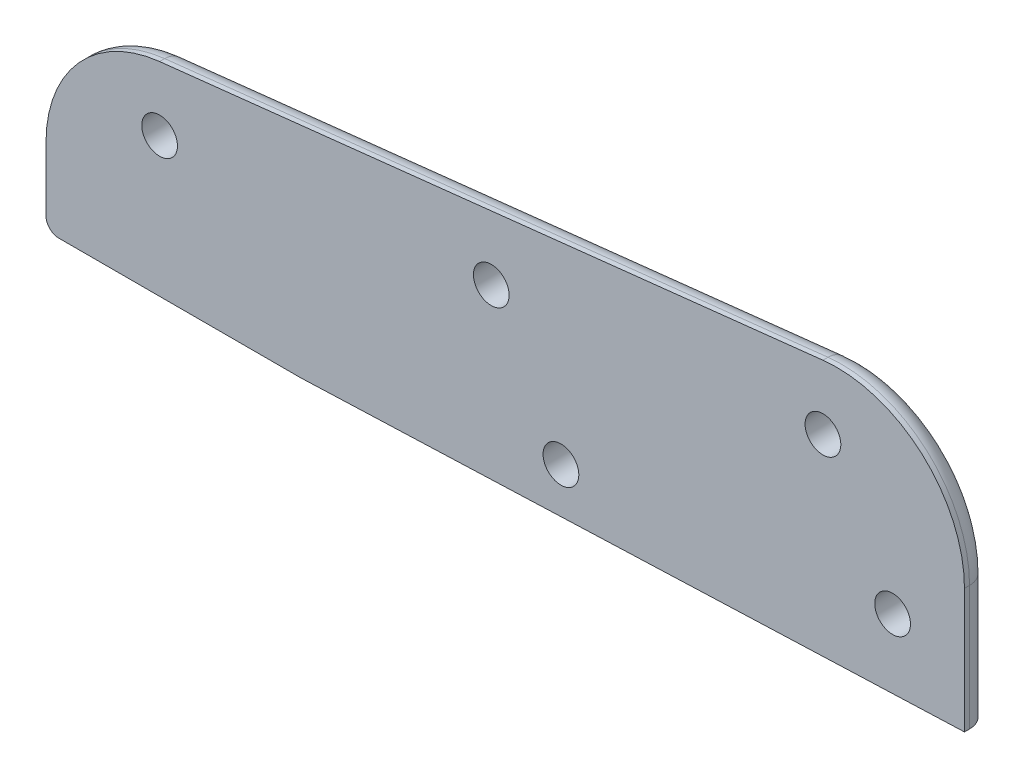
ISO-10303-21;
HEADER;
FILE_DESCRIPTION(('STEP AP214'),'2;1');
FILE_NAME('part.step','',(''),(''),'','','');
FILE_SCHEMA(('AUTOMOTIVE_DESIGN { 1 0 10303 214 1 1 1 1 }'));
ENDSEC;
DATA;
#1=APPLICATION_CONTEXT('core data for automotive mechanical design processes');
#2=APPLICATION_PROTOCOL_DEFINITION('international standard','automotive_design',2000,#1);
#3=PRODUCT_CONTEXT('',#1,'mechanical');
#4=PRODUCT('Part','Part','',(#3));
#5=PRODUCT_RELATED_PRODUCT_CATEGORY('part','',(#4));
#6=PRODUCT_DEFINITION_FORMATION('','',#4);
#7=PRODUCT_DEFINITION_CONTEXT('part definition',#1,'design');
#8=PRODUCT_DEFINITION('design','',#6,#7);
#9=PRODUCT_DEFINITION_SHAPE('','',#8);
#10=(LENGTH_UNIT() NAMED_UNIT(*) SI_UNIT(.MILLI.,.METRE.));
#11=(NAMED_UNIT(*) PLANE_ANGLE_UNIT() SI_UNIT($,.RADIAN.));
#12=(NAMED_UNIT(*) SI_UNIT($,.STERADIAN.) SOLID_ANGLE_UNIT());
#13=UNCERTAINTY_MEASURE_WITH_UNIT(LENGTH_MEASURE(1.E-05),#10,'distance_accuracy_value','');
#14=(GEOMETRIC_REPRESENTATION_CONTEXT(3) GLOBAL_UNCERTAINTY_ASSIGNED_CONTEXT((#13)) GLOBAL_UNIT_ASSIGNED_CONTEXT((#10,
#11,#12)) REPRESENTATION_CONTEXT('',''));
#15=CARTESIAN_POINT('',(0.,0.,0.));
#16=DIRECTION('',(0.,0.,1.));
#17=DIRECTION('',(1.,0.,0.));
#18=AXIS2_PLACEMENT_3D('',#15,#16,#17);
#19=CARTESIAN_POINT('',(-483.453171779433,1624.005304703,3085.));
#20=DIRECTION('',(0.,0.,-1.));
#21=DIRECTION('',(-1.,0.,0.));
#22=AXIS2_PLACEMENT_3D('',#19,#20,#21);
#23=CYLINDRICAL_SURFACE('',#22,50.0000000000001);
#24=DIRECTION('',(0.,0.,-1.));
#25=VECTOR('',#24,1.);
#26=CARTESIAN_POINT('',(-433.453171779433,1624.005304703,3085.));
#27=LINE('',#26,#25);
#28=CARTESIAN_POINT('',(-433.453171779433,1624.005304703,3085.));
#29=VERTEX_POINT('',#28);
#30=CARTESIAN_POINT('',(-433.453171779433,1624.005304703,3083.));
#31=VERTEX_POINT('',#30);
#32=EDGE_CURVE('E222',#29,#31,#27,.T.);
#33=ORIENTED_EDGE('',*,*,#32,.T.);
#34=CARTESIAN_POINT('',(-483.453171779433,1624.005304703,3083.));
#35=DIRECTION('',(0.,0.,1.));
#36=DIRECTION('',(1.,0.,0.));
#37=AXIS2_PLACEMENT_3D('',#34,#35,#36);
#38=CIRCLE('',#37,50.0000000000001);
#39=CARTESIAN_POINT('',(-488.924269857036,1673.70507417757,3083.));
#40=VERTEX_POINT('',#39);
#41=EDGE_CURVE('E144',#31,#40,#38,.T.);
#42=ORIENTED_EDGE('',*,*,#41,.T.);
#43=DIRECTION('',(0.,0.,-1.));
#44=VECTOR('',#43,1.);
#45=CARTESIAN_POINT('',(-488.924269857036,1673.70507417757,3085.));
#46=LINE('',#45,#44);
#47=CARTESIAN_POINT('',(-488.924269857036,1673.70507417757,3085.));
#48=VERTEX_POINT('',#47);
#49=EDGE_CURVE('E125',#48,#40,#46,.T.);
#50=ORIENTED_EDGE('',*,*,#49,.F.);
#51=CARTESIAN_POINT('',(-483.453171779433,1624.005304703,3085.));
#52=DIRECTION('',(0.,0.,1.));
#53=DIRECTION('',(1.,0.,0.));
#54=AXIS2_PLACEMENT_3D('',#51,#52,#53);
#55=CIRCLE('',#54,50.0000000000001);
#56=EDGE_CURVE('E131',#29,#48,#55,.T.);
#57=ORIENTED_EDGE('',*,*,#56,.F.);
#58=EDGE_LOOP('',(#33,#42,#50,#57));
#59=FACE_BOUND('',#58,.T.);
#60=ADVANCED_FACE('F36',(#59),#23,.T.);
#61=CARTESIAN_POINT('',(-488.924269857036,1673.70507417757,3085.));
#62=DIRECTION('',(0.10942196155205,-0.993995389491371,0.));
#63=DIRECTION('',(0.993995389491371,0.10942196155205,0.));
#64=AXIS2_PLACEMENT_3D('',#61,#62,#63);
#65=PLANE('',#64);
#66=ORIENTED_EDGE('',*,*,#49,.T.);
#67=DIRECTION('',(-0.993995389491371,-0.10942196155205,0.));
#68=VECTOR('',#67,1.);
#69=CARTESIAN_POINT('',(-488.924269857036,1673.70507417757,3083.));
#70=LINE('',#69,#68);
#71=CARTESIAN_POINT('',(-748.924269857035,1645.08350278568,3083.));
#72=VERTEX_POINT('',#71);
#73=EDGE_CURVE('E11',#40,#72,#70,.T.);
#74=ORIENTED_EDGE('',*,*,#73,.T.);
#75=DIRECTION('',(0.,0.,-1.));
#76=VECTOR('',#75,1.);
#77=CARTESIAN_POINT('',(-748.924269857035,1645.08350278568,3085.));
#78=LINE('',#77,#76);
#79=CARTESIAN_POINT('',(-748.924269857035,1645.08350278568,3085.));
#80=VERTEX_POINT('',#79);
#81=EDGE_CURVE('E126',#80,#72,#78,.T.);
#82=ORIENTED_EDGE('',*,*,#81,.F.);
#83=DIRECTION('',(-0.993995389491371,-0.10942196155205,0.));
#84=VECTOR('',#83,1.);
#85=CARTESIAN_POINT('',(-488.924269857036,1673.70507417757,3085.));
#86=LINE('',#85,#84);
#87=EDGE_CURVE('E121',#48,#80,#86,.T.);
#88=ORIENTED_EDGE('',*,*,#87,.F.);
#89=EDGE_LOOP('',(#66,#74,#82,#88));
#90=FACE_BOUND('',#89,.T.);
#91=ADVANCED_FACE('F123',(#90),#65,.F.);
#92=CARTESIAN_POINT('',(-743.453171779433,1595.38373331111,3085.));
#93=DIRECTION('',(0.,0.,-1.));
#94=DIRECTION('',(-1.,0.,0.));
#95=AXIS2_PLACEMENT_3D('',#92,#93,#94);
#96=CYLINDRICAL_SURFACE('',#95,50.0000000000001);
#97=ORIENTED_EDGE('',*,*,#81,.T.);
#98=CARTESIAN_POINT('',(-743.453171779433,1595.38373331111,3083.));
#99=DIRECTION('',(0.,0.,1.));
#100=DIRECTION('',(1.,0.,0.));
#101=AXIS2_PLACEMENT_3D('',#98,#99,#100);
#102=CIRCLE('',#101,50.0000000000001);
#103=CARTESIAN_POINT('',(-793.453171779433,1595.38373331111,3083.));
#104=VERTEX_POINT('',#103);
#105=EDGE_CURVE('E46',#72,#104,#102,.T.);
#106=ORIENTED_EDGE('',*,*,#105,.T.);
#107=DIRECTION('',(0.,0.,-1.));
#108=VECTOR('',#107,1.);
#109=CARTESIAN_POINT('',(-793.453171779433,1595.38373331111,3085.));
#110=LINE('',#109,#108);
#111=CARTESIAN_POINT('',(-793.453171779433,1595.38373331111,3085.));
#112=VERTEX_POINT('',#111);
#113=EDGE_CURVE('E150',#112,#104,#110,.T.);
#114=ORIENTED_EDGE('',*,*,#113,.F.);
#115=CARTESIAN_POINT('',(-743.453171779433,1595.38373331111,3085.));
#116=DIRECTION('',(0.,0.,-1.));
#117=DIRECTION('',(-1.,0.,0.));
#118=AXIS2_PLACEMENT_3D('',#115,#116,#117);
#119=CIRCLE('',#118,50.0000000000001);
#120=EDGE_CURVE('E130',#112,#80,#119,.T.);
#121=ORIENTED_EDGE('',*,*,#120,.T.);
#122=EDGE_LOOP('',(#97,#106,#114,#121));
#123=FACE_BOUND('',#122,.T.);
#124=ADVANCED_FACE('F265',(#123),#96,.T.);
#125=CARTESIAN_POINT('',(-793.453171779433,1595.38373331111,3085.));
#126=DIRECTION('',(1.,0.,0.));
#127=DIRECTION('',(0.,0.,-1.));
#128=AXIS2_PLACEMENT_3D('',#125,#126,#127);
#129=PLANE('',#128);
#130=ORIENTED_EDGE('',*,*,#113,.T.);
#131=DIRECTION('',(0.,-1.,0.));
#132=VECTOR('',#131,1.);
#133=CARTESIAN_POINT('',(-793.453171779433,1595.38373331111,3083.));
#134=LINE('',#133,#132);
#135=CARTESIAN_POINT('',(-793.453171779433,1570.37512715189,3083.));
#136=VERTEX_POINT('',#135);
#137=EDGE_CURVE('E181',#104,#136,#134,.T.);
#138=ORIENTED_EDGE('',*,*,#137,.T.);
#139=DIRECTION('',(0.,0.,-1.));
#140=VECTOR('',#139,1.);
#141=CARTESIAN_POINT('',(-793.453171779433,1570.37512715189,3085.));
#142=LINE('',#141,#140);
#143=CARTESIAN_POINT('',(-793.453171779433,1570.37512715189,3085.));
#144=VERTEX_POINT('',#143);
#145=EDGE_CURVE('E148',#136,#144,#142,.F.);
#146=ORIENTED_EDGE('',*,*,#145,.T.);
#147=DIRECTION('',(0.,-1.,0.));
#148=VECTOR('',#147,1.);
#149=CARTESIAN_POINT('',(-793.453171779433,1595.38373331111,3085.));
#150=LINE('',#149,#148);
#151=EDGE_CURVE('E215',#112,#144,#150,.T.);
#152=ORIENTED_EDGE('',*,*,#151,.F.);
#153=EDGE_LOOP('',(#130,#138,#146,#152));
#154=FACE_BOUND('',#153,.T.);
#155=ADVANCED_FACE('F235',(#154),#129,.F.);
#156=CARTESIAN_POINT('',(-793.453171779433,1565.37512715189,3085.));
#157=DIRECTION('',(0.,1.,0.));
#158=DIRECTION('',(0.,0.,1.));
#159=AXIS2_PLACEMENT_3D('',#156,#157,#158);
#160=PLANE('',#159);
#161=DIRECTION('',(0.,0.,-1.));
#162=VECTOR('',#161,1.);
#163=CARTESIAN_POINT('',(-788.453171779433,1565.37512715189,3085.));
#164=LINE('',#163,#162);
#165=CARTESIAN_POINT('',(-788.453171779433,1565.37512715189,3085.));
#166=VERTEX_POINT('',#165);
#167=CARTESIAN_POINT('',(-788.453171779433,1565.37512715189,3083.));
#168=VERTEX_POINT('',#167);
#169=EDGE_CURVE('E145',#166,#168,#164,.T.);
#170=ORIENTED_EDGE('',*,*,#169,.T.);
#171=DIRECTION('',(1.,0.,0.));
#172=VECTOR('',#171,1.);
#173=CARTESIAN_POINT('',(-793.453171779433,1565.37512715189,3083.));
#174=LINE('',#173,#172);
#175=CARTESIAN_POINT('',(-693.453171779433,1565.37512715189,3083.));
#176=VERTEX_POINT('',#175);
#177=EDGE_CURVE('E177',#168,#176,#174,.T.);
#178=ORIENTED_EDGE('',*,*,#177,.T.);
#179=DIRECTION('',(0.,0.,-1.));
#180=VECTOR('',#179,1.);
#181=CARTESIAN_POINT('',(-693.453171779433,1565.37512715189,3085.));
#182=LINE('',#181,#180);
#183=CARTESIAN_POINT('',(-693.453171779433,1565.37512715189,3085.));
#184=VERTEX_POINT('',#183);
#185=EDGE_CURVE('E230',#184,#176,#182,.T.);
#186=ORIENTED_EDGE('',*,*,#185,.F.);
#187=DIRECTION('',(1.,0.,0.));
#188=VECTOR('',#187,1.);
#189=CARTESIAN_POINT('',(-793.453171779433,1565.37512715189,3085.));
#190=LINE('',#189,#188);
#191=EDGE_CURVE('E217',#166,#184,#190,.T.);
#192=ORIENTED_EDGE('',*,*,#191,.F.);
#193=EDGE_LOOP('',(#170,#178,#186,#192));
#194=FACE_BOUND('',#193,.T.);
#195=ADVANCED_FACE('F261',(#194),#160,.F.);
#196=CARTESIAN_POINT('',(-693.453171779433,1565.37512715189,3085.));
#197=DIRECTION('',(-0.0379732750898803,0.999278755092366,0.));
#198=DIRECTION('',(-0.999278755092366,-0.0379732750898803,0.));
#199=AXIS2_PLACEMENT_3D('',#196,#197,#198);
#200=PLANE('',#199);
#201=DIRECTION('',(0.999278755092366,0.0379732750898803,0.));
#202=VECTOR('',#201,1.);
#203=CARTESIAN_POINT('',(-693.453171779433,1565.37512715189,3075.));
#204=LINE('',#203,#202);
#205=CARTESIAN_POINT('',(-482.93063923998,1573.37512715189,3075.));
#206=VERTEX_POINT('',#205);
#207=CARTESIAN_POINT('',(-441.453171779433,1574.95129923989,3075.));
#208=VERTEX_POINT('',#207);
#209=EDGE_CURVE('E141',#206,#208,#204,.T.);
#210=ORIENTED_EDGE('',*,*,#209,.T.);
#211=CARTESIAN_POINT('',(-441.453171779433,1574.95129923989,3083.));
#212=DIRECTION('',(-0.0379732750898803,0.999278755092366,0.));
#213=DIRECTION('',(0.999278755092366,0.0379732750898803,0.));
#214=AXIS2_PLACEMENT_3D('',#211,#212,#213);
#215=ELLIPSE('',#214,8.00577412381847,8.);
#216=CARTESIAN_POINT('',(-433.453171779433,1575.255304703,3083.));
#217=VERTEX_POINT('',#216);
#218=EDGE_CURVE('E174',#208,#217,#215,.F.);
#219=ORIENTED_EDGE('',*,*,#218,.T.);
#220=DIRECTION('',(0.,0.,-1.));
#221=VECTOR('',#220,1.);
#222=CARTESIAN_POINT('',(-433.453171779433,1575.255304703,3085.));
#223=LINE('',#222,#221);
#224=CARTESIAN_POINT('',(-433.453171779433,1575.255304703,3085.));
#225=VERTEX_POINT('',#224);
#226=EDGE_CURVE('E227',#225,#217,#223,.T.);
#227=ORIENTED_EDGE('',*,*,#226,.F.);
#228=DIRECTION('',(0.999278755092366,0.0379732750898803,0.));
#229=VECTOR('',#228,1.);
#230=CARTESIAN_POINT('',(-693.453171779433,1565.37512715189,3085.));
#231=LINE('',#230,#229);
#232=EDGE_CURVE('E219',#184,#225,#231,.T.);
#233=ORIENTED_EDGE('',*,*,#232,.F.);
#234=ORIENTED_EDGE('',*,*,#185,.T.);
#235=CARTESIAN_POINT('',(-482.93063923998,1573.37512715189,3083.));
#236=DIRECTION('',(-0.0379732750898803,0.999278755092366,0.));
#237=DIRECTION('',(0.999278755092366,0.0379732750898803,0.));
#238=AXIS2_PLACEMENT_3D('',#235,#236,#237);
#239=ELLIPSE('',#238,210.674480435636,8.);
#240=EDGE_CURVE('E172',#176,#206,#239,.F.);
#241=ORIENTED_EDGE('',*,*,#240,.T.);
#242=EDGE_LOOP('',(#210,#219,#227,#233,#234,#241));
#243=FACE_BOUND('',#242,.T.);
#244=ADVANCED_FACE('F370',(#243),#200,.F.);
#245=CARTESIAN_POINT('',(-433.453171779433,1575.255304703,3085.));
#246=DIRECTION('',(-1.,0.,0.));
#247=DIRECTION('',(0.,-1.,0.));
#248=AXIS2_PLACEMENT_3D('',#245,#246,#247);
#249=PLANE('',#248);
#250=ORIENTED_EDGE('',*,*,#226,.T.);
#251=DIRECTION('',(0.,1.,0.));
#252=VECTOR('',#251,1.);
#253=CARTESIAN_POINT('',(-433.453171779433,1575.255304703,3083.));
#254=LINE('',#253,#252);
#255=EDGE_CURVE('E157',#217,#31,#254,.T.);
#256=ORIENTED_EDGE('',*,*,#255,.T.);
#257=ORIENTED_EDGE('',*,*,#32,.F.);
#258=DIRECTION('',(0.,1.,0.));
#259=VECTOR('',#258,1.);
#260=CARTESIAN_POINT('',(-433.453171779433,1575.255304703,3085.));
#261=LINE('',#260,#259);
#262=EDGE_CURVE('E137',#225,#29,#261,.T.);
#263=ORIENTED_EDGE('',*,*,#262,.F.);
#264=EDGE_LOOP('',(#250,#256,#257,#263));
#265=FACE_BOUND('',#264,.T.);
#266=ADVANCED_FACE('F363',(#265),#249,.F.);
#267=CARTESIAN_POINT('',(-483.453171779433,1624.005304703,3085.));
#268=DIRECTION('',(0.,0.,1.));
#269=DIRECTION('',(1.,0.,0.));
#270=AXIS2_PLACEMENT_3D('',#267,#268,#269);
#271=PLANE('',#270);
#272=CARTESIAN_POINT('',(-488.924269857036,1648.55405208602,3085.));
#273=DIRECTION('',(0.,0.,-1.));
#274=DIRECTION('',(-1.,0.,0.));
#275=AXIS2_PLACEMENT_3D('',#272,#273,#274);
#276=CIRCLE('',#275,7.00000000000004);
#277=CARTESIAN_POINT('',(-495.924269857036,1648.55405208602,3085.));
#278=VERTEX_POINT('',#277);
#279=EDGE_CURVE('E225',#278,#278,#276,.T.);
#280=ORIENTED_EDGE('',*,*,#279,.T.);
#281=EDGE_LOOP('',(#280));
#282=FACE_BOUND('',#281,.T.);
#283=CARTESIAN_POINT('',(-618.924269857036,1634.24326639007,3085.));
#284=DIRECTION('',(0.,0.,-1.));
#285=DIRECTION('',(-1.,0.,0.));
#286=AXIS2_PLACEMENT_3D('',#283,#284,#285);
#287=CIRCLE('',#286,7.00000000000004);
#288=CARTESIAN_POINT('',(-625.924269857036,1634.24326639007,3085.));
#289=VERTEX_POINT('',#288);
#290=EDGE_CURVE('E478',#289,#289,#287,.T.);
#291=ORIENTED_EDGE('',*,*,#290,.T.);
#292=EDGE_LOOP('',(#291));
#293=FACE_BOUND('',#292,.T.);
#294=CARTESIAN_POINT('',(-748.924269857036,1619.93248069413,3085.));
#295=DIRECTION('',(0.,0.,-1.));
#296=DIRECTION('',(-1.,0.,0.));
#297=AXIS2_PLACEMENT_3D('',#294,#295,#296);
#298=CIRCLE('',#297,7.00000000000004);
#299=CARTESIAN_POINT('',(-755.924269857036,1619.93248069413,3085.));
#300=VERTEX_POINT('',#299);
#301=EDGE_CURVE('E482',#300,#300,#298,.T.);
#302=ORIENTED_EDGE('',*,*,#301,.T.);
#303=EDGE_LOOP('',(#302));
#304=FACE_BOUND('',#303,.T.);
#305=CARTESIAN_POINT('',(-461.617868508506,1601.25797757849,3085.));
#306=DIRECTION('',(0.,0.,-1.));
#307=DIRECTION('',(-1.,0.,0.));
#308=AXIS2_PLACEMENT_3D('',#305,#306,#307);
#309=CIRCLE('',#308,6.99999999999999);
#310=CARTESIAN_POINT('',(-468.617868508506,1601.25797757849,3085.));
#311=VERTEX_POINT('',#310);
#312=EDGE_CURVE('E486',#311,#311,#309,.T.);
#313=ORIENTED_EDGE('',*,*,#312,.T.);
#314=EDGE_LOOP('',(#313));
#315=FACE_BOUND('',#314,.T.);
#316=CARTESIAN_POINT('',(-591.617868508506,1586.94719188255,3085.));
#317=DIRECTION('',(0.,0.,-1.));
#318=DIRECTION('',(-1.,0.,0.));
#319=AXIS2_PLACEMENT_3D('',#316,#317,#318);
#320=CIRCLE('',#319,7.00000000000004);
#321=CARTESIAN_POINT('',(-598.617868508506,1586.94719188255,3085.));
#322=VERTEX_POINT('',#321);
#323=EDGE_CURVE('E205',#322,#322,#320,.T.);
#324=ORIENTED_EDGE('',*,*,#323,.T.);
#325=EDGE_LOOP('',(#324));
#326=FACE_BOUND('',#325,.T.);
#327=ORIENTED_EDGE('',*,*,#151,.T.);
#328=CARTESIAN_POINT('',(-788.453171779433,1570.37512715189,3085.));
#329=DIRECTION('',(0.,0.,1.));
#330=DIRECTION('',(1.,0.,0.));
#331=AXIS2_PLACEMENT_3D('',#328,#329,#330);
#332=CIRCLE('',#331,5.);
#333=EDGE_CURVE('E155',#144,#166,#332,.T.);
#334=ORIENTED_EDGE('',*,*,#333,.T.);
#335=ORIENTED_EDGE('',*,*,#191,.T.);
#336=ORIENTED_EDGE('',*,*,#232,.T.);
#337=ORIENTED_EDGE('',*,*,#262,.T.);
#338=ORIENTED_EDGE('',*,*,#56,.T.);
#339=ORIENTED_EDGE('',*,*,#87,.T.);
#340=ORIENTED_EDGE('',*,*,#120,.F.);
#341=EDGE_LOOP('',(#327,#334,#335,#336,#337,#338,#339,#340));
#342=FACE_BOUND('',#341,.T.);
#343=ADVANCED_FACE('F135',(#282,#293,#304,#315,#326,#342),#271,.T.);
#344=CARTESIAN_POINT('',(-483.453171779433,1624.005304703,3075.));
#345=DIRECTION('',(0.,0.,1.));
#346=DIRECTION('',(1.,0.,0.));
#347=AXIS2_PLACEMENT_3D('',#344,#345,#346);
#348=PLANE('',#347);
#349=CARTESIAN_POINT('',(-488.924269857036,1648.55405208602,3075.));
#350=DIRECTION('',(0.,0.,-1.));
#351=DIRECTION('',(-1.,0.,0.));
#352=AXIS2_PLACEMENT_3D('',#349,#350,#351);
#353=CIRCLE('',#352,7.00000000000004);
#354=CARTESIAN_POINT('',(-495.924269857036,1648.55405208602,3075.));
#355=VERTEX_POINT('',#354);
#356=EDGE_CURVE('E499',#355,#355,#353,.T.);
#357=ORIENTED_EDGE('',*,*,#356,.F.);
#358=EDGE_LOOP('',(#357));
#359=FACE_BOUND('',#358,.T.);
#360=CARTESIAN_POINT('',(-618.924269857036,1634.24326639007,3075.));
#361=DIRECTION('',(0.,0.,-1.));
#362=DIRECTION('',(-1.,0.,0.));
#363=AXIS2_PLACEMENT_3D('',#360,#361,#362);
#364=CIRCLE('',#363,7.00000000000004);
#365=CARTESIAN_POINT('',(-625.924269857036,1634.24326639007,3075.));
#366=VERTEX_POINT('',#365);
#367=EDGE_CURVE('E495',#366,#366,#364,.T.);
#368=ORIENTED_EDGE('',*,*,#367,.F.);
#369=EDGE_LOOP('',(#368));
#370=FACE_BOUND('',#369,.T.);
#371=CARTESIAN_POINT('',(-748.924269857036,1619.93248069413,3075.));
#372=DIRECTION('',(0.,0.,-1.));
#373=DIRECTION('',(-1.,0.,0.));
#374=AXIS2_PLACEMENT_3D('',#371,#372,#373);
#375=CIRCLE('',#374,7.00000000000004);
#376=CARTESIAN_POINT('',(-755.924269857036,1619.93248069413,3075.));
#377=VERTEX_POINT('',#376);
#378=EDGE_CURVE('E488',#377,#377,#375,.T.);
#379=ORIENTED_EDGE('',*,*,#378,.F.);
#380=EDGE_LOOP('',(#379));
#381=FACE_BOUND('',#380,.T.);
#382=CARTESIAN_POINT('',(-461.617868508506,1601.25797757849,3075.));
#383=DIRECTION('',(0.,0.,-1.));
#384=DIRECTION('',(-1.,0.,0.));
#385=AXIS2_PLACEMENT_3D('',#382,#383,#384);
#386=CIRCLE('',#385,6.99999999999999);
#387=CARTESIAN_POINT('',(-468.617868508506,1601.25797757849,3075.));
#388=VERTEX_POINT('',#387);
#389=EDGE_CURVE('E210',#388,#388,#386,.T.);
#390=ORIENTED_EDGE('',*,*,#389,.F.);
#391=EDGE_LOOP('',(#390));
#392=FACE_BOUND('',#391,.T.);
#393=CARTESIAN_POINT('',(-591.617868508506,1586.94719188255,3075.));
#394=DIRECTION('',(0.,0.,-1.));
#395=DIRECTION('',(-1.,0.,0.));
#396=AXIS2_PLACEMENT_3D('',#393,#394,#395);
#397=CIRCLE('',#396,7.00000000000004);
#398=CARTESIAN_POINT('',(-598.617868508506,1586.94719188255,3075.));
#399=VERTEX_POINT('',#398);
#400=EDGE_CURVE('E199',#399,#399,#397,.T.);
#401=ORIENTED_EDGE('',*,*,#400,.F.);
#402=EDGE_LOOP('',(#401));
#403=FACE_BOUND('',#402,.T.);
#404=CARTESIAN_POINT('',(-483.453171779433,1624.005304703,3075.));
#405=DIRECTION('',(0.,0.,1.));
#406=DIRECTION('',(1.,0.,0.));
#407=AXIS2_PLACEMENT_3D('',#404,#405,#406);
#408=CIRCLE('',#407,42.0000000000001);
#409=CARTESIAN_POINT('',(-488.048894164619,1665.75311106164,3075.));
#410=VERTEX_POINT('',#409);
#411=CARTESIAN_POINT('',(-441.453171779433,1624.005304703,3075.));
#412=VERTEX_POINT('',#411);
#413=EDGE_CURVE('E168',#410,#412,#408,.F.);
#414=ORIENTED_EDGE('',*,*,#413,.T.);
#415=DIRECTION('',(0.,1.,0.));
#416=VECTOR('',#415,1.);
#417=CARTESIAN_POINT('',(-441.453171779433,1624.005304703,3075.));
#418=LINE('',#417,#416);
#419=EDGE_CURVE('E170',#412,#208,#418,.F.);
#420=ORIENTED_EDGE('',*,*,#419,.T.);
#421=ORIENTED_EDGE('',*,*,#209,.F.);
#422=DIRECTION('',(1.,0.,0.));
#423=VECTOR('',#422,1.);
#424=CARTESIAN_POINT('',(-483.453171779433,1573.37512715189,3075.));
#425=LINE('',#424,#423);
#426=CARTESIAN_POINT('',(-785.453171779433,1573.37512715189,3075.));
#427=VERTEX_POINT('',#426);
#428=EDGE_CURVE('E166',#206,#427,#425,.F.);
#429=ORIENTED_EDGE('',*,*,#428,.T.);
#430=DIRECTION('',(0.,-1.,0.));
#431=VECTOR('',#430,1.);
#432=CARTESIAN_POINT('',(-785.453171779433,1624.005304703,3075.));
#433=LINE('',#432,#431);
#434=CARTESIAN_POINT('',(-785.453171779433,1595.38373331111,3075.));
#435=VERTEX_POINT('',#434);
#436=EDGE_CURVE('E164',#427,#435,#433,.F.);
#437=ORIENTED_EDGE('',*,*,#436,.T.);
#438=CARTESIAN_POINT('',(-743.453171779433,1595.38373331111,3075.));
#439=DIRECTION('',(0.,0.,1.));
#440=DIRECTION('',(1.,0.,0.));
#441=AXIS2_PLACEMENT_3D('',#438,#439,#440);
#442=CIRCLE('',#441,42.0000000000001);
#443=CARTESIAN_POINT('',(-748.048894164619,1637.13153966975,3075.));
#444=VERTEX_POINT('',#443);
#445=EDGE_CURVE('E162',#435,#444,#442,.F.);
#446=ORIENTED_EDGE('',*,*,#445,.T.);
#447=DIRECTION('',(-0.993995389491371,-0.10942196155205,0.));
#448=VECTOR('',#447,1.);
#449=CARTESIAN_POINT('',(-488.048894164619,1665.75311106164,3075.));
#450=LINE('',#449,#448);
#451=EDGE_CURVE('E160',#444,#410,#450,.F.);
#452=ORIENTED_EDGE('',*,*,#451,.T.);
#453=EDGE_LOOP('',(#414,#420,#421,#429,#437,#446,#452));
#454=FACE_BOUND('',#453,.T.);
#455=ADVANCED_FACE('F247',(#359,#370,#381,#392,#403,#454),#348,.F.);
#456=CARTESIAN_POINT('',(-591.617868508506,1586.94719188255,3085.));
#457=DIRECTION('',(0.,0.,-1.));
#458=DIRECTION('',(-1.,0.,0.));
#459=AXIS2_PLACEMENT_3D('',#456,#457,#458);
#460=CYLINDRICAL_SURFACE('',#459,7.00000000000004);
#461=ORIENTED_EDGE('',*,*,#323,.F.);
#462=EDGE_LOOP('',(#461));
#463=FACE_BOUND('',#462,.T.);
#464=ORIENTED_EDGE('',*,*,#400,.T.);
#465=EDGE_LOOP('',(#464));
#466=FACE_BOUND('',#465,.T.);
#467=ADVANCED_FACE('F342',(#463,#466),#460,.F.);
#468=CARTESIAN_POINT('',(-461.617868508506,1601.25797757849,3085.));
#469=DIRECTION('',(0.,0.,-1.));
#470=DIRECTION('',(-1.,0.,0.));
#471=AXIS2_PLACEMENT_3D('',#468,#469,#470);
#472=CYLINDRICAL_SURFACE('',#471,6.99999999999999);
#473=ORIENTED_EDGE('',*,*,#312,.F.);
#474=EDGE_LOOP('',(#473));
#475=FACE_BOUND('',#474,.T.);
#476=ORIENTED_EDGE('',*,*,#389,.T.);
#477=EDGE_LOOP('',(#476));
#478=FACE_BOUND('',#477,.T.);
#479=ADVANCED_FACE('F334',(#475,#478),#472,.F.);
#480=CARTESIAN_POINT('',(-748.924269857036,1619.93248069413,3085.));
#481=DIRECTION('',(0.,0.,-1.));
#482=DIRECTION('',(-1.,0.,0.));
#483=AXIS2_PLACEMENT_3D('',#480,#481,#482);
#484=CYLINDRICAL_SURFACE('',#483,7.00000000000004);
#485=ORIENTED_EDGE('',*,*,#301,.F.);
#486=EDGE_LOOP('',(#485));
#487=FACE_BOUND('',#486,.T.);
#488=ORIENTED_EDGE('',*,*,#378,.T.);
#489=EDGE_LOOP('',(#488));
#490=FACE_BOUND('',#489,.T.);
#491=ADVANCED_FACE('F326',(#487,#490),#484,.F.);
#492=CARTESIAN_POINT('',(-618.924269857036,1634.24326639007,3085.));
#493=DIRECTION('',(0.,0.,-1.));
#494=DIRECTION('',(-1.,0.,0.));
#495=AXIS2_PLACEMENT_3D('',#492,#493,#494);
#496=CYLINDRICAL_SURFACE('',#495,7.00000000000004);
#497=ORIENTED_EDGE('',*,*,#290,.F.);
#498=EDGE_LOOP('',(#497));
#499=FACE_BOUND('',#498,.T.);
#500=ORIENTED_EDGE('',*,*,#367,.T.);
#501=EDGE_LOOP('',(#500));
#502=FACE_BOUND('',#501,.T.);
#503=ADVANCED_FACE('F317',(#499,#502),#496,.F.);
#504=CARTESIAN_POINT('',(-488.924269857036,1648.55405208602,3085.));
#505=DIRECTION('',(0.,0.,-1.));
#506=DIRECTION('',(-1.,0.,0.));
#507=AXIS2_PLACEMENT_3D('',#504,#505,#506);
#508=CYLINDRICAL_SURFACE('',#507,7.00000000000004);
#509=ORIENTED_EDGE('',*,*,#279,.F.);
#510=EDGE_LOOP('',(#509));
#511=FACE_BOUND('',#510,.T.);
#512=ORIENTED_EDGE('',*,*,#356,.T.);
#513=EDGE_LOOP('',(#512));
#514=FACE_BOUND('',#513,.T.);
#515=ADVANCED_FACE('F281',(#511,#514),#508,.F.);
#516=CARTESIAN_POINT('',(-788.453171779433,1570.37512715189,3085.));
#517=DIRECTION('',(0.,0.,-1.));
#518=DIRECTION('',(-1.,0.,0.));
#519=AXIS2_PLACEMENT_3D('',#516,#517,#518);
#520=CYLINDRICAL_SURFACE('',#519,5.);
#521=ORIENTED_EDGE('',*,*,#145,.F.);
#522=CARTESIAN_POINT('',(-788.453171779433,1570.37512715189,3083.));
#523=DIRECTION('',(0.,0.,1.));
#524=DIRECTION('',(1.,0.,0.));
#525=AXIS2_PLACEMENT_3D('',#522,#523,#524);
#526=CIRCLE('',#525,5.);
#527=EDGE_CURVE('E179',#136,#168,#526,.T.);
#528=ORIENTED_EDGE('',*,*,#527,.T.);
#529=ORIENTED_EDGE('',*,*,#169,.F.);
#530=ORIENTED_EDGE('',*,*,#333,.F.);
#531=EDGE_LOOP('',(#521,#528,#529,#530));
#532=FACE_BOUND('',#531,.T.);
#533=ADVANCED_FACE('F257',(#532),#520,.T.);
#534=CARTESIAN_POINT('',(-793.453171779433,1573.37512715189,3083.));
#535=DIRECTION('',(1.,0.,0.));
#536=DIRECTION('',(0.,0.,-1.));
#537=AXIS2_PLACEMENT_3D('',#534,#535,#536);
#538=CYLINDRICAL_SURFACE('',#537,8.);
#539=ORIENTED_EDGE('',*,*,#240,.F.);
#540=ORIENTED_EDGE('',*,*,#177,.F.);
#541=CARTESIAN_POINT('',(-785.453171779433,1573.37512715189,3083.));
#542=DIRECTION('',(-0.936329177569044,0.351123441588392,0.));
#543=DIRECTION('',(-0.351123441588392,-0.936329177569045,0.));
#544=AXIS2_PLACEMENT_3D('',#541,#542,#543);
#545=ELLIPSE('',#544,8.54400374531754,8.);
#546=EDGE_CURVE('E197',#427,#168,#545,.T.);
#547=ORIENTED_EDGE('',*,*,#546,.F.);
#548=ORIENTED_EDGE('',*,*,#428,.F.);
#549=EDGE_LOOP('',(#539,#540,#547,#548));
#550=FACE_BOUND('',#549,.T.);
#551=ADVANCED_FACE('F38',(#550),#538,.T.);
#552=CARTESIAN_POINT('',(-785.453171779433,1573.37512715189,3091.));
#553=CARTESIAN_POINT('',(-785.453171779433,1573.37512715189,3091.));
#554=CARTESIAN_POINT('',(-785.453171779433,1573.37512715189,3091.));
#555=CARTESIAN_POINT('',(-785.627465673183,1573.30976694173,3090.9999899588));
#556=CARTESIAN_POINT('',(-785.572999156956,1573.25529977436,3090.99999169946));
#557=CARTESIAN_POINT('',(-785.51853198959,1573.20083325814,3090.9999899588));
#558=CARTESIAN_POINT('',(-785.801734425972,1573.24441615943,3090.99430421345));
#559=CARTESIAN_POINT('',(-785.692893707977,1573.13540522334,3090.99786418205));
#560=CARTESIAN_POINT('',(-785.583882771886,1573.02656450535,3090.99430421345));
#561=CARTESIAN_POINT('',(-786.149912280492,1573.11384946399,3090.97151369032));
#562=CARTESIAN_POINT('',(-785.93296537836,1572.89533355296,3090.98928855405));
#563=CARTESIAN_POINT('',(-785.71444946733,1572.67838665083,3090.97151369032));
#564=CARTESIAN_POINT('',(-786.323821351006,1573.04863356255,3090.95440795996));
#565=CARTESIAN_POINT('',(-786.053314089591,1572.77498484173,3090.98282780153));
#566=CARTESIAN_POINT('',(-785.779665368773,1572.50447758031,3090.95440795996));
#567=CARTESIAN_POINT('',(-786.841443848195,1572.8545251261,3090.88626325818));
#568=CARTESIAN_POINT('',(-786.413877343617,1572.4144215877,3090.95687388876));
#569=CARTESIAN_POINT('',(-785.973773805219,1571.98685508313,3090.88626325818));
#570=CARTESIAN_POINT('',(-787.184134452597,1572.72601614945,3090.8183971832));
#571=CARTESIAN_POINT('',(-786.655728550405,1572.17257038092,3090.93072763961));
#572=CARTESIAN_POINT('',(-786.10228278187,1571.64416447872,3090.8183971832));
#573=CARTESIAN_POINT('',(-787.857617905558,1572.47345985459,3090.63794221816));
#574=CARTESIAN_POINT('',(-787.141100865267,1571.68719806605,3090.85902323652));
#575=CARTESIAN_POINT('',(-786.35483907673,1570.97068102576,3090.63794221816));
#576=CARTESIAN_POINT('',(-788.188513904798,1572.34937385487,3090.52612255475));
#577=CARTESIAN_POINT('',(-787.385963125392,1571.44233580593,3090.81337466007));
#578=CARTESIAN_POINT('',(-786.478925076445,1570.63978502652,3090.52612255475));
#579=CARTESIAN_POINT('',(-788.832730671993,1572.10779256718,3090.25927773442));
#580=CARTESIAN_POINT('',(-787.879023925031,1570.94927500629,3090.69911709394));
#581=CARTESIAN_POINT('',(-786.720506364143,1569.99556825933,3090.25927773442));
#582=CARTESIAN_POINT('',(-789.146283589768,1571.99021022301,3090.1053847768));
#583=CARTESIAN_POINT('',(-788.128516730547,1570.69978220077,3090.63039145793));
#584=CARTESIAN_POINT('',(-786.838088708309,1569.68201534155,3090.1053847768));
#585=CARTESIAN_POINT('',(-789.750291697963,1571.76370718244,3089.75666138396));
#586=CARTESIAN_POINT('',(-788.632255028118,1570.1960439032,3090.4640903514));
#587=CARTESIAN_POINT('',(-787.064591748882,1569.07800723336,3089.75666138396));
#588=CARTESIAN_POINT('',(-790.041164413455,1571.65462991413,3089.56328990846));
#589=CARTESIAN_POINT('',(-788.887704370181,1569.94059456114,3090.36640870993));
#590=CARTESIAN_POINT('',(-787.173669017192,1568.78713451786,3089.56328990846));
#591=CARTESIAN_POINT('',(-790.594644080278,1571.44707503907,3089.13858773685));
#592=CARTESIAN_POINT('',(-789.403966628424,1569.4243323029,3090.13313916171));
#593=CARTESIAN_POINT('',(-787.38122389225,1568.23365485104,3089.13858773685));
#594=CARTESIAN_POINT('',(-790.857905070584,1571.3483521677,3088.90897837888));
#595=CARTESIAN_POINT('',(-789.665823746684,1569.16247518463,3089.99753146999));
#596=CARTESIAN_POINT('',(-787.479946763615,1567.97039386073,3088.90897837888));
#597=CARTESIAN_POINT('',(-791.351406100004,1571.16328928167,3088.41547114246));
#598=CARTESIAN_POINT('',(-790.193390863904,1568.63490806742,3089.67552804307));
#599=CARTESIAN_POINT('',(-787.665009649647,1567.47689283132,3088.41547114246));
#600=CARTESIAN_POINT('',(-791.582575098573,1571.07660090721,3088.15345075501));
#601=CARTESIAN_POINT('',(-790.45988824112,1568.3684106902,3089.48934278098));
#602=CARTESIAN_POINT('',(-787.751698024111,1567.24572383275,3088.15345075501));
#603=CARTESIAN_POINT('',(-792.007649146489,1570.91719813924,3087.59946855875));
#604=CARTESIAN_POINT('',(-790.990934147161,1567.83736478416,3089.049774839));
#605=CARTESIAN_POINT('',(-787.911100792079,1566.82064978483,3087.59946855875));
#606=CARTESIAN_POINT('',(-792.20276210071,1570.84403078141,3087.30938192547));
#607=CARTESIAN_POINT('',(-791.255898362478,1567.57240056884,3088.79708141136));
#608=CARTESIAN_POINT('',(-787.984268149912,1566.62553683061,3087.30938192547));
#609=CARTESIAN_POINT('',(-792.552099635803,1570.71302920575,3086.70428165667));
#610=CARTESIAN_POINT('',(-791.77095763785,1567.05734129347,3088.20731921008));
#611=CARTESIAN_POINT('',(-788.115269725572,1566.27619929552,3086.70428165667));
#612=CARTESIAN_POINT('',(-792.707749453965,1570.65466052394,3086.39093470568));
#613=CARTESIAN_POINT('',(-792.02100464395,1566.80729428737,3087.87179606992));
#614=CARTESIAN_POINT('',(-788.173638407383,1566.12054947735,3086.39093470568));
#615=CARTESIAN_POINT('',(-792.975293888241,1570.55433136108,3085.74497221248));
#616=CARTESIAN_POINT('',(-792.484188565287,1566.34411036603,3087.10536514027));
#617=CARTESIAN_POINT('',(-788.273967570236,1565.85300504308,3085.74497221248));
#618=CARTESIAN_POINT('',(-793.088669973561,1570.51181532909,3085.41360107819));
#619=CARTESIAN_POINT('',(-792.6968286371,1566.13147029422,3086.67731964195));
#620=CARTESIAN_POINT('',(-788.316483602231,1565.73962895776,3085.41360107819));
#621=CARTESIAN_POINT('',(-793.269727119322,1570.44391889943,3084.73780419035));
#622=CARTESIAN_POINT('',(-793.056106025294,1565.77219290603,3085.73172372752));
#623=CARTESIAN_POINT('',(-788.384380031892,1565.558571812,3084.73780419035));
#624=CARTESIAN_POINT('',(-793.338678021991,1570.41806231093,3084.39406918195));
#625=CARTESIAN_POINT('',(-793.202017402274,1565.62628152905,3085.21868634009));
#626=CARTESIAN_POINT('',(-788.410236620392,1565.48962090933,3084.39406918195));
#627=CARTESIAN_POINT('',(-793.430027751299,1570.38380616244,3083.70008990214));
#628=CARTESIAN_POINT('',(-793.400821867145,1565.42747706418,3084.13420060253));
#629=CARTESIAN_POINT('',(-788.444492768883,1565.39827118002,3083.70008990214));
#630=CARTESIAN_POINT('',(-793.453171779433,1570.37512715189,3083.35004495107));
#631=CARTESIAN_POINT('',(-793.453171779433,1565.37512715189,3083.56875515422));
#632=CARTESIAN_POINT('',(-788.453171779433,1565.37512715189,3083.35004495107));
#633=CARTESIAN_POINT('',(-793.453171779433,1570.37512715189,3082.64995504893));
#634=CARTESIAN_POINT('',(-793.453171779433,1565.37512715189,3082.43124484578));
#635=CARTESIAN_POINT('',(-788.453171779433,1565.37512715189,3082.64995504893));
#636=CARTESIAN_POINT('',(-793.430027751299,1570.38380616244,3082.29991009786));
#637=CARTESIAN_POINT('',(-793.400821867145,1565.42747706418,3081.86579939747));
#638=CARTESIAN_POINT('',(-788.444492768883,1565.39827118002,3082.29991009786));
#639=CARTESIAN_POINT('',(-793.338678021991,1570.41806231093,3081.60593081805));
#640=CARTESIAN_POINT('',(-793.202017402274,1565.62628152905,3080.78131365991));
#641=CARTESIAN_POINT('',(-788.410236620392,1565.48962090933,3081.60593081805));
#642=CARTESIAN_POINT('',(-793.269727119322,1570.44391889943,3081.26219580964));
#643=CARTESIAN_POINT('',(-793.056106025294,1565.77219290603,3080.26827627248));
#644=CARTESIAN_POINT('',(-788.384380031892,1565.558571812,3081.26219580964));
#645=CARTESIAN_POINT('',(-793.088669973561,1570.51181532909,3080.58639892181));
#646=CARTESIAN_POINT('',(-792.6968286371,1566.13147029422,3079.32268035805));
#647=CARTESIAN_POINT('',(-788.316483602231,1565.73962895776,3080.58639892181));
#648=CARTESIAN_POINT('',(-792.975293888241,1570.55433136108,3080.25502778752));
#649=CARTESIAN_POINT('',(-792.484188565287,1566.34411036603,3078.89463485973));
#650=CARTESIAN_POINT('',(-788.273967570236,1565.85300504308,3080.25502778752));
#651=CARTESIAN_POINT('',(-792.707749453965,1570.65466052394,3079.60906529432));
#652=CARTESIAN_POINT('',(-792.02100464395,1566.80729428737,3078.12820393008));
#653=CARTESIAN_POINT('',(-788.173638407383,1566.12054947735,3079.60906529432));
#654=CARTESIAN_POINT('',(-792.552099635803,1570.71302920575,3079.29571834333));
#655=CARTESIAN_POINT('',(-791.77095763785,1567.05734129347,3077.79268078992));
#656=CARTESIAN_POINT('',(-788.115269725572,1566.27619929552,3079.29571834333));
#657=CARTESIAN_POINT('',(-792.20276210071,1570.84403078141,3078.69061807453));
#658=CARTESIAN_POINT('',(-791.255898362478,1567.57240056884,3077.20291858864));
#659=CARTESIAN_POINT('',(-787.984268149912,1566.62553683061,3078.69061807453));
#660=CARTESIAN_POINT('',(-792.007649146489,1570.91719813924,3078.40053144125));
#661=CARTESIAN_POINT('',(-790.990934147161,1567.83736478416,3076.950225161));
#662=CARTESIAN_POINT('',(-787.911100792079,1566.82064978483,3078.40053144125));
#663=CARTESIAN_POINT('',(-791.582575098573,1571.07660090721,3077.84654924499));
#664=CARTESIAN_POINT('',(-790.45988824112,1568.3684106902,3076.51065721902));
#665=CARTESIAN_POINT('',(-787.751698024111,1567.24572383275,3077.84654924499));
#666=CARTESIAN_POINT('',(-791.351406100004,1571.16328928167,3077.58452885754));
#667=CARTESIAN_POINT('',(-790.193390863904,1568.63490806742,3076.32447195692));
#668=CARTESIAN_POINT('',(-787.665009649647,1567.47689283132,3077.58452885754));
#669=CARTESIAN_POINT('',(-790.857905070584,1571.3483521677,3077.09102162112));
#670=CARTESIAN_POINT('',(-789.665823746684,1569.16247518463,3076.00246853001));
#671=CARTESIAN_POINT('',(-787.479946763615,1567.97039386073,3077.09102162112));
#672=CARTESIAN_POINT('',(-790.594644080278,1571.44707503907,3076.86141226315));
#673=CARTESIAN_POINT('',(-789.403966628424,1569.4243323029,3075.86686083829));
#674=CARTESIAN_POINT('',(-787.38122389225,1568.23365485104,3076.86141226315));
#675=CARTESIAN_POINT('',(-790.041164413455,1571.65462991413,3076.43671009154));
#676=CARTESIAN_POINT('',(-788.887704370181,1569.94059456114,3075.63359129007));
#677=CARTESIAN_POINT('',(-787.173669017192,1568.78713451786,3076.43671009154));
#678=CARTESIAN_POINT('',(-789.750291697963,1571.76370718244,3076.24333861604));
#679=CARTESIAN_POINT('',(-788.632255028118,1570.1960439032,3075.5359096486));
#680=CARTESIAN_POINT('',(-787.064591748882,1569.07800723336,3076.24333861604));
#681=CARTESIAN_POINT('',(-789.146283589768,1571.99021022301,3075.8946152232));
#682=CARTESIAN_POINT('',(-788.128516730547,1570.69978220077,3075.36960854207));
#683=CARTESIAN_POINT('',(-786.838088708309,1569.68201534155,3075.8946152232));
#684=CARTESIAN_POINT('',(-788.832730671993,1572.10779256718,3075.74072226558));
#685=CARTESIAN_POINT('',(-787.879023925031,1570.94927500629,3075.30088290606));
#686=CARTESIAN_POINT('',(-786.720506364143,1569.99556825933,3075.74072226558));
#687=CARTESIAN_POINT('',(-788.188513904798,1572.34937385487,3075.47387744525));
#688=CARTESIAN_POINT('',(-787.385963125392,1571.44233580593,3075.18662533993));
#689=CARTESIAN_POINT('',(-786.478925076445,1570.63978502652,3075.47387744525));
#690=CARTESIAN_POINT('',(-787.857617905558,1572.47345985459,3075.36205778184));
#691=CARTESIAN_POINT('',(-787.141100865267,1571.68719806605,3075.14097676348));
#692=CARTESIAN_POINT('',(-786.35483907673,1570.97068102576,3075.36205778184));
#693=CARTESIAN_POINT('',(-787.184134452597,1572.72601614945,3075.1816028168));
#694=CARTESIAN_POINT('',(-786.655728550405,1572.17257038091,3075.06927236039));
#695=CARTESIAN_POINT('',(-786.10228278187,1571.64416447872,3075.1816028168));
#696=CARTESIAN_POINT('',(-786.841443848195,1572.8545251261,3075.11373674182));
#697=CARTESIAN_POINT('',(-786.413877343617,1572.4144215877,3075.04312611124));
#698=CARTESIAN_POINT('',(-785.973773805219,1571.98685508313,3075.11373674182));
#699=CARTESIAN_POINT('',(-786.323821351006,1573.04863356255,3075.04559204004));
#700=CARTESIAN_POINT('',(-786.053314089591,1572.77498484173,3075.01717219847));
#701=CARTESIAN_POINT('',(-785.779665368773,1572.50447758031,3075.04559204004));
#702=CARTESIAN_POINT('',(-786.149912280492,1573.11384946399,3075.02848630968));
#703=CARTESIAN_POINT('',(-785.93296537836,1572.89533355296,3075.01071144595));
#704=CARTESIAN_POINT('',(-785.71444946733,1572.67838665083,3075.02848630968));
#705=CARTESIAN_POINT('',(-785.801734425973,1573.24441615943,3075.00569578655));
#706=CARTESIAN_POINT('',(-785.692893707977,1573.13540522334,3075.00213581795));
#707=CARTESIAN_POINT('',(-785.583882771886,1573.02656450535,3075.00569578655));
#708=CARTESIAN_POINT('',(-785.627465673183,1573.30976694173,3075.0000100412));
#709=CARTESIAN_POINT('',(-785.572999156957,1573.25529977436,3075.00000830054));
#710=CARTESIAN_POINT('',(-785.51853198959,1573.20083325814,3075.0000100412));
#711=CARTESIAN_POINT('',(-785.453171779433,1573.37512715189,3075.));
#712=CARTESIAN_POINT('',(-785.453171779433,1573.37512715189,3075.));
#713=CARTESIAN_POINT('',(-785.453171779433,1573.37512715189,3075.));
#714=(BOUNDED_SURFACE() B_SPLINE_SURFACE(3,2,((#552,#553,#554),(#555,#556,#557),(#558,#559,
#560),(#561,#562,#563),(#564,#565,#566),(#567,#568,#569),(#570,#571,#572),(#573,#574,#575),
(#576,#577,#578),(#579,#580,#581),(#582,#583,#584),(#585,#586,#587),(#588,#589,#590),(#591,#592,
#593),(#594,#595,#596),(#597,#598,#599),(#600,#601,#602),(#603,#604,#605),(#606,#607,#608),
(#609,#610,#611),(#612,#613,#614),(#615,#616,#617),(#618,#619,#620),(#621,#622,#623),(#624,#625,
#626),(#627,#628,#629),(#630,#631,#632),(#633,#634,#635),(#636,#637,#638),(#639,#640,#641),
(#642,#643,#644),(#645,#646,#647),(#648,#649,#650),(#651,#652,#653),(#654,#655,#656),(#657,#658,
#659),(#660,#661,#662),(#663,#664,#665),(#666,#667,#668),(#669,#670,#671),(#672,#673,#674),
(#675,#676,#677),(#678,#679,#680),(#681,#682,#683),(#684,#685,#686),(#687,#688,#689),(#690,#691,
#692),(#693,#694,#695),(#696,#697,#698),(#699,#700,#701),(#702,#703,#704),(#705,#706,#707),
(#708,#709,#710),(#711,#712,#713)),.UNSPECIFIED.,.F.,.F.,.F.) B_SPLINE_SURFACE_WITH_KNOTS((4,2,
2,2,2,2,2,2,2,2,2,2,2,2,2,2,2,2,2,2,2,2,2,2,2,2,4),(3,3),(0.,0.277248089016449,
0.554519306999115,1.10417738269518,1.64461606854101,2.17174137494,2.68208824838153,
3.17304524234972,3.64308642765989,4.092000177263,4.52108804375218,4.9332815816144,
5.33309839671403,5.72635557572475,6.11961275473547,6.5194295698351,6.93162310769732,
7.3607109741865,7.80962472378961,8.27966590909978,8.77062290306796,9.2809697765095,
9.80809508290849,10.3485337687543,10.8981918444504,11.175463062433,11.4527111514495),(0.,1.),
.UNSPECIFIED.) GEOMETRIC_REPRESENTATION_ITEM() RATIONAL_B_SPLINE_SURFACE(((1.,1.,1.),(1.,
0.99999996126362,1.),(1.,0.999643922941491,1.),(1.,0.998220838286358,1.),(1.,0.997153732641157,
1.),(1.,0.992912442662745,1.),(1.,0.988698138464846,1.),(1.,0.977616679304322,1.),(1.,
0.970795206105286,1.),(1.,0.954789240884272,1.),(1.,0.945667100032627,1.),(1.,0.925487939163264,
1.),(1.,0.914501748600799,1.),(1.,0.891170005673144,1.),(1.,0.878891958919865,1.),(1.,
0.853706991171872,1.),(1.,0.840849145478559,1.),(1.,0.815387454891641,1.),(1.,0.802798170214696,
1.),(1.,0.778880732145947,1.),(1.,0.767521437015662,1.),(1.,0.747118527019454,1.),(1.,
0.73800134692011,1.),(1.,0.723039691285839,1.),(1.,0.717105167895105,1.),(1.,0.709170186453631,
1.),(1.,0.707106781186548,1.),(1.,0.707106781186548,1.),(1.,0.709170186453631,1.),(1.,
0.717105167895105,1.),(1.,0.723039691285839,1.),(1.,0.73800134692011,1.),(1.,0.747118527019454,
1.),(1.,0.767521437015662,1.),(1.,0.778880732145947,1.),(1.,0.802798170214696,1.),(1.,
0.815387454891641,1.),(1.,0.840849145478559,1.),(1.,0.853706991171872,1.),(1.,0.878891958919865,
1.),(1.,0.891170005673144,1.),(1.,0.914501748600799,1.),(1.,0.925487939163264,1.),(1.,
0.945667100032627,1.),(1.,0.954789240884272,1.),(1.,0.970795206105286,1.),(1.,0.977616679304322,
1.),(1.,0.988698138464846,1.),(1.,0.992912442662745,1.),(1.,0.997153732641156,1.),(1.,
0.998220838286358,1.),(1.,0.999643922941491,1.),(1.,0.999999961263619,1.),(1.,1.,1.))) REPRESENTATION_ITEM('') SURFACE());
#715=ORIENTED_EDGE('',*,*,#546,.T.);
#716=ORIENTED_EDGE('',*,*,#527,.F.);
#717=CARTESIAN_POINT('',(-785.453171779433,1573.37512715189,3083.));
#718=DIRECTION('',(-0.35112344158838,0.936329177569049,0.));
#719=DIRECTION('',(-0.936329177569049,-0.35112344158838,0.));
#720=AXIS2_PLACEMENT_3D('',#717,#718,#719);
#721=ELLIPSE('',#720,8.5440037453175,8.);
#722=EDGE_CURVE('E195',#427,#136,#721,.T.);
#723=ORIENTED_EDGE('',*,*,#722,.F.);
#724=EDGE_LOOP('',(#715,#716,#723));
#725=FACE_BOUND('',#724,.T.);
#726=ADVANCED_FACE('F254',(#725),#714,.T.);
#727=CARTESIAN_POINT('',(-785.453171779433,1595.38373331111,3083.));
#728=DIRECTION('',(0.,-1.,0.));
#729=DIRECTION('',(0.,0.,-1.));
#730=AXIS2_PLACEMENT_3D('',#727,#728,#729);
#731=CYLINDRICAL_SURFACE('',#730,8.);
#732=ORIENTED_EDGE('',*,*,#722,.T.);
#733=ORIENTED_EDGE('',*,*,#137,.F.);
#734=CARTESIAN_POINT('',(-785.453171779433,1595.38373331111,3083.));
#735=DIRECTION('',(0.,1.,0.));
#736=DIRECTION('',(0.,0.,1.));
#737=AXIS2_PLACEMENT_3D('',#734,#735,#736);
#738=CIRCLE('',#737,8.);
#739=EDGE_CURVE('E192',#435,#104,#738,.T.);
#740=ORIENTED_EDGE('',*,*,#739,.F.);
#741=ORIENTED_EDGE('',*,*,#436,.F.);
#742=EDGE_LOOP('',(#732,#733,#740,#741));
#743=FACE_BOUND('',#742,.T.);
#744=ADVANCED_FACE('F239',(#743),#731,.T.);
#745=CARTESIAN_POINT('',(-743.453171779433,1595.38373331111,3083.));
#746=DIRECTION('',(0.,0.,1.));
#747=DIRECTION('',(1.,0.,0.));
#748=AXIS2_PLACEMENT_3D('',#745,#746,#747);
#749=TOROIDAL_SURFACE('',#748,42.0000000000001,8.);
#750=ORIENTED_EDGE('',*,*,#739,.T.);
#751=ORIENTED_EDGE('',*,*,#105,.F.);
#752=CARTESIAN_POINT('',(-748.048894164619,1637.13153966975,3083.));
#753=DIRECTION('',(0.993995389491371,0.109421961552044,0.));
#754=DIRECTION('',(-0.109421961552044,0.993995389491371,0.));
#755=AXIS2_PLACEMENT_3D('',#752,#753,#754);
#756=CIRCLE('',#755,8.);
#757=EDGE_CURVE('E189',#444,#72,#756,.T.);
#758=ORIENTED_EDGE('',*,*,#757,.F.);
#759=ORIENTED_EDGE('',*,*,#445,.F.);
#760=EDGE_LOOP('',(#750,#751,#758,#759));
#761=FACE_BOUND('',#760,.T.);
#762=ADVANCED_FACE('F243',(#761),#749,.T.);
#763=CARTESIAN_POINT('',(-488.048894164619,1665.75311106164,3083.));
#764=DIRECTION('',(-0.993995389491371,-0.10942196155205,0.));
#765=DIRECTION('',(0.10942196155205,-0.993995389491371,0.));
#766=AXIS2_PLACEMENT_3D('',#763,#764,#765);
#767=CYLINDRICAL_SURFACE('',#766,8.);
#768=ORIENTED_EDGE('',*,*,#757,.T.);
#769=ORIENTED_EDGE('',*,*,#73,.F.);
#770=CARTESIAN_POINT('',(-488.048894164619,1665.75311106164,3083.));
#771=DIRECTION('',(0.99399538949137,0.109421961552051,0.));
#772=DIRECTION('',(-0.109421961552051,0.993995389491371,0.));
#773=AXIS2_PLACEMENT_3D('',#770,#771,#772);
#774=CIRCLE('',#773,8.);
#775=EDGE_CURVE('E186',#410,#40,#774,.T.);
#776=ORIENTED_EDGE('',*,*,#775,.F.);
#777=ORIENTED_EDGE('',*,*,#451,.F.);
#778=EDGE_LOOP('',(#768,#769,#776,#777));
#779=FACE_BOUND('',#778,.T.);
#780=ADVANCED_FACE('F289',(#779),#767,.T.);
#781=CARTESIAN_POINT('',(-483.453171779433,1624.005304703,3083.));
#782=DIRECTION('',(0.,0.,1.));
#783=DIRECTION('',(1.,0.,0.));
#784=AXIS2_PLACEMENT_3D('',#781,#782,#783);
#785=TOROIDAL_SURFACE('',#784,42.0000000000001,8.);
#786=ORIENTED_EDGE('',*,*,#775,.T.);
#787=ORIENTED_EDGE('',*,*,#41,.F.);
#788=CARTESIAN_POINT('',(-441.453171779433,1624.005304703,3083.));
#789=DIRECTION('',(0.,-1.,0.));
#790=DIRECTION('',(0.,0.,-1.));
#791=AXIS2_PLACEMENT_3D('',#788,#789,#790);
#792=CIRCLE('',#791,8.);
#793=EDGE_CURVE('E184',#412,#31,#792,.T.);
#794=ORIENTED_EDGE('',*,*,#793,.F.);
#795=ORIENTED_EDGE('',*,*,#413,.F.);
#796=EDGE_LOOP('',(#786,#787,#794,#795));
#797=FACE_BOUND('',#796,.T.);
#798=ADVANCED_FACE('F285',(#797),#785,.T.);
#799=CARTESIAN_POINT('',(-441.453171779433,1575.255304703,3083.));
#800=DIRECTION('',(0.,1.,0.));
#801=DIRECTION('',(-1.,0.,0.));
#802=AXIS2_PLACEMENT_3D('',#799,#800,#801);
#803=CYLINDRICAL_SURFACE('',#802,8.);
#804=ORIENTED_EDGE('',*,*,#218,.F.);
#805=ORIENTED_EDGE('',*,*,#419,.F.);
#806=ORIENTED_EDGE('',*,*,#793,.T.);
#807=ORIENTED_EDGE('',*,*,#255,.F.);
#808=EDGE_LOOP('',(#804,#805,#806,#807));
#809=FACE_BOUND('',#808,.T.);
#810=ADVANCED_FACE('F282',(#809),#803,.T.);
#811=CLOSED_SHELL('',(#60,#91,#124,#155,#195,#244,#266,#343,#455,#467,#479,#491,#503,#515,#533,
#551,#726,#744,#762,#780,#798,#810));
#812=MANIFOLD_SOLID_BREP('B2',#811);
#813=ADVANCED_BREP_SHAPE_REPRESENTATION('',(#18,#812),#14);
#814=SHAPE_DEFINITION_REPRESENTATION(#9,#813);
ENDSEC;
END-ISO-10303-21;
